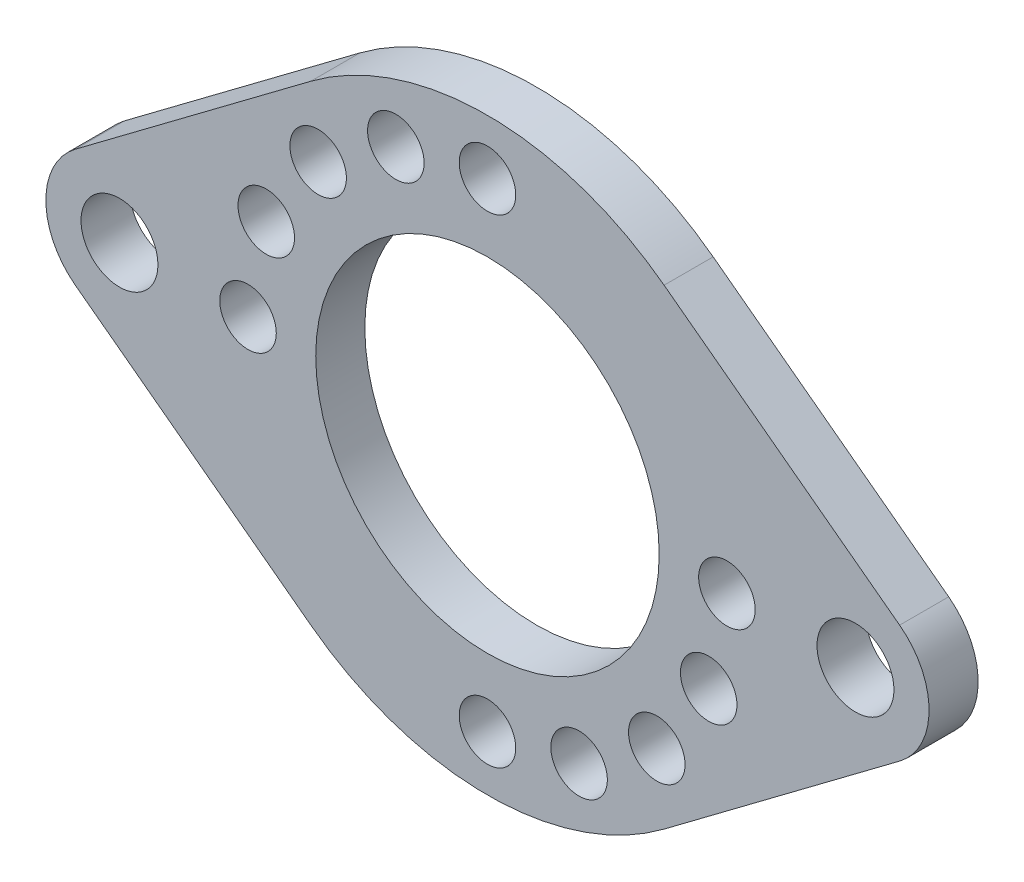
ISO-10303-21;
HEADER;
FILE_DESCRIPTION(('STEP AP214'),'2;1');
FILE_NAME('part.step','',(''),(''),'','','');
FILE_SCHEMA(('AUTOMOTIVE_DESIGN { 1 0 10303 214 1 1 1 1 }'));
ENDSEC;
DATA;
#1=APPLICATION_CONTEXT('core data for automotive mechanical design processes');
#2=APPLICATION_PROTOCOL_DEFINITION('international standard','automotive_design',2000,#1);
#3=PRODUCT_CONTEXT('',#1,'mechanical');
#4=PRODUCT('Part','Part','',(#3));
#5=PRODUCT_RELATED_PRODUCT_CATEGORY('part','',(#4));
#6=PRODUCT_DEFINITION_FORMATION('','',#4);
#7=PRODUCT_DEFINITION_CONTEXT('part definition',#1,'design');
#8=PRODUCT_DEFINITION('design','',#6,#7);
#9=PRODUCT_DEFINITION_SHAPE('','',#8);
#10=(LENGTH_UNIT() NAMED_UNIT(*) SI_UNIT(.MILLI.,.METRE.));
#11=(NAMED_UNIT(*) PLANE_ANGLE_UNIT() SI_UNIT($,.RADIAN.));
#12=(NAMED_UNIT(*) SI_UNIT($,.STERADIAN.) SOLID_ANGLE_UNIT());
#13=UNCERTAINTY_MEASURE_WITH_UNIT(LENGTH_MEASURE(1.E-05),#10,'distance_accuracy_value','');
#14=(GEOMETRIC_REPRESENTATION_CONTEXT(3) GLOBAL_UNCERTAINTY_ASSIGNED_CONTEXT((#13)) GLOBAL_UNIT_ASSIGNED_CONTEXT((#10,
#11,#12)) REPRESENTATION_CONTEXT('',''));
#15=CARTESIAN_POINT('',(0.,0.,0.));
#16=DIRECTION('',(0.,0.,1.));
#17=DIRECTION('',(1.,0.,0.));
#18=AXIS2_PLACEMENT_3D('',#15,#16,#17);
#19=CARTESIAN_POINT('',(0.,0.,-1.5875));
#20=DIRECTION('',(0.,0.,1.));
#21=DIRECTION('',(1.,0.,0.));
#22=AXIS2_PLACEMENT_3D('',#19,#20,#21);
#23=PLANE('',#22);
#24=CARTESIAN_POINT('',(0.,0.,-1.5875));
#25=DIRECTION('',(0.,0.,-1.));
#26=DIRECTION('',(-1.,0.,0.));
#27=AXIS2_PLACEMENT_3D('',#24,#25,#26);
#28=CIRCLE('',#27,11.1125);
#29=CARTESIAN_POINT('',(-11.1125,0.,-1.5875));
#30=VERTEX_POINT('',#29);
#31=EDGE_CURVE('E168',#30,#30,#28,.F.);
#32=ORIENTED_EDGE('',*,*,#31,.T.);
#33=EDGE_LOOP('',(#32));
#34=FACE_BOUND('',#33,.T.);
#35=CARTESIAN_POINT('',(-23.8125,0.,-1.5875));
#36=DIRECTION('',(0.,0.,-1.));
#37=DIRECTION('',(-1.,0.,0.));
#38=AXIS2_PLACEMENT_3D('',#35,#36,#37);
#39=CIRCLE('',#38,4.7625);
#40=CARTESIAN_POINT('',(-26.67,3.81,-1.5875));
#41=VERTEX_POINT('',#40);
#42=CARTESIAN_POINT('',(-26.67,-3.81,-1.5875));
#43=VERTEX_POINT('',#42);
#44=EDGE_CURVE('E172',#41,#43,#39,.F.);
#45=ORIENTED_EDGE('',*,*,#44,.F.);
#46=DIRECTION('',(-0.8,-0.6,0.));
#47=VECTOR('',#46,1.);
#48=CARTESIAN_POINT('',(-11.43,15.24,-1.5875));
#49=LINE('',#48,#47);
#50=CARTESIAN_POINT('',(-11.43,15.24,-1.5875));
#51=VERTEX_POINT('',#50);
#52=EDGE_CURVE('E111',#51,#41,#49,.T.);
#53=ORIENTED_EDGE('',*,*,#52,.F.);
#54=CARTESIAN_POINT('',(0.,0.,-1.5875));
#55=DIRECTION('',(0.,0.,-1.));
#56=DIRECTION('',(-1.,0.,0.));
#57=AXIS2_PLACEMENT_3D('',#54,#55,#56);
#58=CIRCLE('',#57,19.05);
#59=CARTESIAN_POINT('',(11.43,15.24,-1.5875));
#60=VERTEX_POINT('',#59);
#61=EDGE_CURVE('E116',#60,#51,#58,.F.);
#62=ORIENTED_EDGE('',*,*,#61,.F.);
#63=DIRECTION('',(0.8,-0.6,0.));
#64=VECTOR('',#63,1.);
#65=CARTESIAN_POINT('',(11.43,15.24,-1.5875));
#66=LINE('',#65,#64);
#67=CARTESIAN_POINT('',(26.67,3.81,-1.5875));
#68=VERTEX_POINT('',#67);
#69=EDGE_CURVE('E115',#60,#68,#66,.T.);
#70=ORIENTED_EDGE('',*,*,#69,.T.);
#71=CARTESIAN_POINT('',(23.8125,0.,-1.5875));
#72=DIRECTION('',(0.,0.,-1.));
#73=DIRECTION('',(-1.,0.,0.));
#74=AXIS2_PLACEMENT_3D('',#71,#72,#73);
#75=CIRCLE('',#74,4.7625);
#76=CARTESIAN_POINT('',(26.67,-3.81,-1.5875));
#77=VERTEX_POINT('',#76);
#78=EDGE_CURVE('E95',#77,#68,#75,.F.);
#79=ORIENTED_EDGE('',*,*,#78,.F.);
#80=DIRECTION('',(-0.8,-0.6,0.));
#81=VECTOR('',#80,1.);
#82=CARTESIAN_POINT('',(11.43,-15.24,-1.5875));
#83=LINE('',#82,#81);
#84=CARTESIAN_POINT('',(11.43,-15.24,-1.5875));
#85=VERTEX_POINT('',#84);
#86=EDGE_CURVE('E92',#77,#85,#83,.T.);
#87=ORIENTED_EDGE('',*,*,#86,.T.);
#88=CARTESIAN_POINT('',(0.,0.,-1.5875));
#89=DIRECTION('',(0.,0.,-1.));
#90=DIRECTION('',(-1.,0.,0.));
#91=AXIS2_PLACEMENT_3D('',#88,#89,#90);
#92=CIRCLE('',#91,19.05);
#93=CARTESIAN_POINT('',(-11.43,-15.24,-1.5875));
#94=VERTEX_POINT('',#93);
#95=EDGE_CURVE('E79',#94,#85,#92,.F.);
#96=ORIENTED_EDGE('',*,*,#95,.F.);
#97=DIRECTION('',(-0.8,0.6,0.));
#98=VECTOR('',#97,1.);
#99=CARTESIAN_POINT('',(-11.43,-15.24,-1.5875));
#100=LINE('',#99,#98);
#101=EDGE_CURVE('E89',#94,#43,#100,.T.);
#102=ORIENTED_EDGE('',*,*,#101,.T.);
#103=EDGE_LOOP('',(#45,#53,#62,#70,#79,#87,#96,#102));
#104=FACE_BOUND('',#103,.T.);
#105=CARTESIAN_POINT('',(0.,15.494,-1.5875));
#106=DIRECTION('',(0.,0.,1.));
#107=DIRECTION('',(1.,0.,0.));
#108=AXIS2_PLACEMENT_3D('',#105,#106,#107);
#109=CIRCLE('',#108,1.82879999999999);
#110=CARTESIAN_POINT('',(1.82879999999999,15.494,-1.5875));
#111=VERTEX_POINT('',#110);
#112=EDGE_CURVE('E110',#111,#111,#109,.T.);
#113=ORIENTED_EDGE('',*,*,#112,.T.);
#114=EDGE_LOOP('',(#113));
#115=FACE_BOUND('',#114,.T.);
#116=CARTESIAN_POINT('',(-15.494,0.,-1.5875));
#117=DIRECTION('',(0.,0.,1.));
#118=DIRECTION('',(1.,0.,0.));
#119=AXIS2_PLACEMENT_3D('',#116,#117,#118);
#120=CIRCLE('',#119,1.82879999999999);
#121=CARTESIAN_POINT('',(-13.6652,0.,-1.5875));
#122=VERTEX_POINT('',#121);
#123=EDGE_CURVE('E180',#122,#122,#120,.T.);
#124=ORIENTED_EDGE('',*,*,#123,.T.);
#125=EDGE_LOOP('',(#124));
#126=FACE_BOUND('',#125,.T.);
#127=CARTESIAN_POINT('',(-14.3145894767299,5.92929710106476,-1.5875));
#128=DIRECTION('',(0.,0.,1.));
#129=DIRECTION('',(1.,0.,0.));
#130=AXIS2_PLACEMENT_3D('',#127,#128,#129);
#131=CIRCLE('',#130,1.82879999999999);
#132=CARTESIAN_POINT('',(-12.4857894767299,5.92929710106476,-1.5875));
#133=VERTEX_POINT('',#132);
#134=EDGE_CURVE('E183',#133,#133,#131,.T.);
#135=ORIENTED_EDGE('',*,*,#134,.T.);
#136=EDGE_LOOP('',(#135));
#137=FACE_BOUND('',#136,.T.);
#138=CARTESIAN_POINT('',(-5.92929710106471,14.3145894767299,-1.5875));
#139=DIRECTION('',(0.,0.,1.));
#140=DIRECTION('',(1.,0.,0.));
#141=AXIS2_PLACEMENT_3D('',#138,#139,#140);
#142=CIRCLE('',#141,1.82879999999999);
#143=CARTESIAN_POINT('',(-4.10049710106472,14.3145894767299,-1.5875));
#144=VERTEX_POINT('',#143);
#145=EDGE_CURVE('E186',#144,#144,#142,.T.);
#146=ORIENTED_EDGE('',*,*,#145,.T.);
#147=EDGE_LOOP('',(#146));
#148=FACE_BOUND('',#147,.T.);
#149=CARTESIAN_POINT('',(-10.9559124677044,10.9559124677043,-1.5875));
#150=DIRECTION('',(0.,0.,1.));
#151=DIRECTION('',(1.,0.,0.));
#152=AXIS2_PLACEMENT_3D('',#149,#150,#151);
#153=CIRCLE('',#152,1.82879999999999);
#154=CARTESIAN_POINT('',(-9.1271124677044,10.9559124677043,-1.5875));
#155=VERTEX_POINT('',#154);
#156=EDGE_CURVE('E189',#155,#155,#153,.T.);
#157=ORIENTED_EDGE('',*,*,#156,.T.);
#158=EDGE_LOOP('',(#157));
#159=FACE_BOUND('',#158,.T.);
#160=CARTESIAN_POINT('',(0.,-15.494,-1.5875));
#161=DIRECTION('',(0.,0.,1.));
#162=DIRECTION('',(1.,0.,0.));
#163=AXIS2_PLACEMENT_3D('',#160,#161,#162);
#164=CIRCLE('',#163,1.82879999999999);
#165=CARTESIAN_POINT('',(1.82879999999999,-15.494,-1.5875));
#166=VERTEX_POINT('',#165);
#167=EDGE_CURVE('E192',#166,#166,#164,.T.);
#168=ORIENTED_EDGE('',*,*,#167,.T.);
#169=EDGE_LOOP('',(#168));
#170=FACE_BOUND('',#169,.T.);
#171=CARTESIAN_POINT('',(15.494,0.,-1.5875));
#172=DIRECTION('',(0.,0.,1.));
#173=DIRECTION('',(1.,0.,0.));
#174=AXIS2_PLACEMENT_3D('',#171,#172,#173);
#175=CIRCLE('',#174,1.82879999999999);
#176=CARTESIAN_POINT('',(17.3228,0.,-1.5875));
#177=VERTEX_POINT('',#176);
#178=EDGE_CURVE('E195',#177,#177,#175,.T.);
#179=ORIENTED_EDGE('',*,*,#178,.T.);
#180=EDGE_LOOP('',(#179));
#181=FACE_BOUND('',#180,.T.);
#182=CARTESIAN_POINT('',(14.3145894767299,-5.92929710106476,-1.5875));
#183=DIRECTION('',(0.,0.,1.));
#184=DIRECTION('',(1.,0.,0.));
#185=AXIS2_PLACEMENT_3D('',#182,#183,#184);
#186=CIRCLE('',#185,1.82879999999999);
#187=CARTESIAN_POINT('',(16.1433894767298,-5.92929710106476,-1.5875));
#188=VERTEX_POINT('',#187);
#189=EDGE_CURVE('E198',#188,#188,#186,.T.);
#190=ORIENTED_EDGE('',*,*,#189,.T.);
#191=EDGE_LOOP('',(#190));
#192=FACE_BOUND('',#191,.T.);
#193=CARTESIAN_POINT('',(5.92929710106471,-14.3145894767299,-1.5875));
#194=DIRECTION('',(0.,0.,1.));
#195=DIRECTION('',(1.,0.,0.));
#196=AXIS2_PLACEMENT_3D('',#193,#194,#195);
#197=CIRCLE('',#196,1.82879999999999);
#198=CARTESIAN_POINT('',(7.7580971010647,-14.3145894767299,-1.5875));
#199=VERTEX_POINT('',#198);
#200=EDGE_CURVE('E201',#199,#199,#197,.T.);
#201=ORIENTED_EDGE('',*,*,#200,.T.);
#202=EDGE_LOOP('',(#201));
#203=FACE_BOUND('',#202,.T.);
#204=CARTESIAN_POINT('',(10.9559124677044,-10.9559124677043,-1.5875));
#205=DIRECTION('',(0.,0.,1.));
#206=DIRECTION('',(1.,0.,0.));
#207=AXIS2_PLACEMENT_3D('',#204,#205,#206);
#208=CIRCLE('',#207,1.82879999999999);
#209=CARTESIAN_POINT('',(12.7847124677044,-10.9559124677043,-1.5875));
#210=VERTEX_POINT('',#209);
#211=EDGE_CURVE('E204',#210,#210,#208,.T.);
#212=ORIENTED_EDGE('',*,*,#211,.T.);
#213=EDGE_LOOP('',(#212));
#214=FACE_BOUND('',#213,.T.);
#215=CARTESIAN_POINT('',(-23.8125,0.,-1.5875));
#216=DIRECTION('',(0.,0.,1.));
#217=DIRECTION('',(1.,0.,0.));
#218=AXIS2_PLACEMENT_3D('',#215,#216,#217);
#219=CIRCLE('',#218,2.48919999999999);
#220=CARTESIAN_POINT('',(-21.3233,0.,-1.5875));
#221=VERTEX_POINT('',#220);
#222=EDGE_CURVE('E206',#221,#221,#219,.T.);
#223=ORIENTED_EDGE('',*,*,#222,.T.);
#224=EDGE_LOOP('',(#223));
#225=FACE_BOUND('',#224,.T.);
#226=CARTESIAN_POINT('',(23.8125,0.,-1.5875));
#227=DIRECTION('',(0.,0.,1.));
#228=DIRECTION('',(1.,0.,0.));
#229=AXIS2_PLACEMENT_3D('',#226,#227,#228);
#230=CIRCLE('',#229,2.48919999999999);
#231=CARTESIAN_POINT('',(26.3017,0.,-1.5875));
#232=VERTEX_POINT('',#231);
#233=EDGE_CURVE('E20',#232,#232,#230,.T.);
#234=ORIENTED_EDGE('',*,*,#233,.T.);
#235=EDGE_LOOP('',(#234));
#236=FACE_BOUND('',#235,.T.);
#237=ADVANCED_FACE('F17',(#34,#104,#115,#126,#137,#148,#159,#170,#181,#192,#203,#214,#225,#236),
#23,.F.);
#238=CARTESIAN_POINT('',(23.8125,0.,1.5875));
#239=DIRECTION('',(0.,0.,1.));
#240=DIRECTION('',(1.,0.,0.));
#241=AXIS2_PLACEMENT_3D('',#238,#239,#240);
#242=CYLINDRICAL_SURFACE('',#241,2.48919999999999);
#243=CARTESIAN_POINT('',(23.8125,0.,1.5875));
#244=DIRECTION('',(0.,0.,1.));
#245=DIRECTION('',(1.,0.,0.));
#246=AXIS2_PLACEMENT_3D('',#243,#244,#245);
#247=CIRCLE('',#246,2.48919999999999);
#248=CARTESIAN_POINT('',(26.3017,0.,1.5875));
#249=VERTEX_POINT('',#248);
#250=EDGE_CURVE('E165',#249,#249,#247,.F.);
#251=ORIENTED_EDGE('',*,*,#250,.F.);
#252=EDGE_LOOP('',(#251));
#253=FACE_BOUND('',#252,.T.);
#254=ORIENTED_EDGE('',*,*,#233,.F.);
#255=EDGE_LOOP('',(#254));
#256=FACE_BOUND('',#255,.T.);
#257=ADVANCED_FACE('F214',(#253,#256),#242,.F.);
#258=CARTESIAN_POINT('',(-23.8125,0.,1.5875));
#259=DIRECTION('',(0.,0.,1.));
#260=DIRECTION('',(1.,0.,0.));
#261=AXIS2_PLACEMENT_3D('',#258,#259,#260);
#262=CYLINDRICAL_SURFACE('',#261,2.48919999999999);
#263=CARTESIAN_POINT('',(-23.8125,0.,1.5875));
#264=DIRECTION('',(0.,0.,1.));
#265=DIRECTION('',(1.,0.,0.));
#266=AXIS2_PLACEMENT_3D('',#263,#264,#265);
#267=CIRCLE('',#266,2.48919999999999);
#268=CARTESIAN_POINT('',(-21.3233,0.,1.5875));
#269=VERTEX_POINT('',#268);
#270=EDGE_CURVE('E162',#269,#269,#267,.F.);
#271=ORIENTED_EDGE('',*,*,#270,.F.);
#272=EDGE_LOOP('',(#271));
#273=FACE_BOUND('',#272,.T.);
#274=ORIENTED_EDGE('',*,*,#222,.F.);
#275=EDGE_LOOP('',(#274));
#276=FACE_BOUND('',#275,.T.);
#277=ADVANCED_FACE('F216',(#273,#276),#262,.F.);
#278=CARTESIAN_POINT('',(10.9559124677044,-10.9559124677043,1.5875));
#279=DIRECTION('',(0.,0.,1.));
#280=DIRECTION('',(1.,0.,0.));
#281=AXIS2_PLACEMENT_3D('',#278,#279,#280);
#282=CYLINDRICAL_SURFACE('',#281,1.82879999999999);
#283=CARTESIAN_POINT('',(10.9559124677044,-10.9559124677043,1.5875));
#284=DIRECTION('',(0.,0.,1.));
#285=DIRECTION('',(1.,0.,0.));
#286=AXIS2_PLACEMENT_3D('',#283,#284,#285);
#287=CIRCLE('',#286,1.82879999999999);
#288=CARTESIAN_POINT('',(12.7847124677044,-10.9559124677043,1.5875));
#289=VERTEX_POINT('',#288);
#290=EDGE_CURVE('E159',#289,#289,#287,.F.);
#291=ORIENTED_EDGE('',*,*,#290,.F.);
#292=EDGE_LOOP('',(#291));
#293=FACE_BOUND('',#292,.T.);
#294=ORIENTED_EDGE('',*,*,#211,.F.);
#295=EDGE_LOOP('',(#294));
#296=FACE_BOUND('',#295,.T.);
#297=ADVANCED_FACE('F223',(#293,#296),#282,.F.);
#298=CARTESIAN_POINT('',(5.92929710106471,-14.3145894767299,1.5875));
#299=DIRECTION('',(0.,0.,1.));
#300=DIRECTION('',(1.,0.,0.));
#301=AXIS2_PLACEMENT_3D('',#298,#299,#300);
#302=CYLINDRICAL_SURFACE('',#301,1.82879999999999);
#303=CARTESIAN_POINT('',(5.92929710106471,-14.3145894767299,1.5875));
#304=DIRECTION('',(0.,0.,1.));
#305=DIRECTION('',(1.,0.,0.));
#306=AXIS2_PLACEMENT_3D('',#303,#304,#305);
#307=CIRCLE('',#306,1.82879999999999);
#308=CARTESIAN_POINT('',(7.7580971010647,-14.3145894767299,1.5875));
#309=VERTEX_POINT('',#308);
#310=EDGE_CURVE('E156',#309,#309,#307,.F.);
#311=ORIENTED_EDGE('',*,*,#310,.F.);
#312=EDGE_LOOP('',(#311));
#313=FACE_BOUND('',#312,.T.);
#314=ORIENTED_EDGE('',*,*,#200,.F.);
#315=EDGE_LOOP('',(#314));
#316=FACE_BOUND('',#315,.T.);
#317=ADVANCED_FACE('F299',(#313,#316),#302,.F.);
#318=CARTESIAN_POINT('',(14.3145894767299,-5.92929710106476,1.5875));
#319=DIRECTION('',(0.,0.,1.));
#320=DIRECTION('',(1.,0.,0.));
#321=AXIS2_PLACEMENT_3D('',#318,#319,#320);
#322=CYLINDRICAL_SURFACE('',#321,1.82879999999999);
#323=CARTESIAN_POINT('',(14.3145894767299,-5.92929710106476,1.5875));
#324=DIRECTION('',(0.,0.,1.));
#325=DIRECTION('',(1.,0.,0.));
#326=AXIS2_PLACEMENT_3D('',#323,#324,#325);
#327=CIRCLE('',#326,1.82879999999999);
#328=CARTESIAN_POINT('',(16.1433894767298,-5.92929710106476,1.5875));
#329=VERTEX_POINT('',#328);
#330=EDGE_CURVE('E153',#329,#329,#327,.F.);
#331=ORIENTED_EDGE('',*,*,#330,.F.);
#332=EDGE_LOOP('',(#331));
#333=FACE_BOUND('',#332,.T.);
#334=ORIENTED_EDGE('',*,*,#189,.F.);
#335=EDGE_LOOP('',(#334));
#336=FACE_BOUND('',#335,.T.);
#337=ADVANCED_FACE('F295',(#333,#336),#322,.F.);
#338=CARTESIAN_POINT('',(15.494,0.,1.5875));
#339=DIRECTION('',(0.,0.,1.));
#340=DIRECTION('',(1.,0.,0.));
#341=AXIS2_PLACEMENT_3D('',#338,#339,#340);
#342=CYLINDRICAL_SURFACE('',#341,1.82879999999999);
#343=CARTESIAN_POINT('',(15.494,0.,1.5875));
#344=DIRECTION('',(0.,0.,1.));
#345=DIRECTION('',(1.,0.,0.));
#346=AXIS2_PLACEMENT_3D('',#343,#344,#345);
#347=CIRCLE('',#346,1.82879999999999);
#348=CARTESIAN_POINT('',(17.3228,0.,1.5875));
#349=VERTEX_POINT('',#348);
#350=EDGE_CURVE('E150',#349,#349,#347,.F.);
#351=ORIENTED_EDGE('',*,*,#350,.F.);
#352=EDGE_LOOP('',(#351));
#353=FACE_BOUND('',#352,.T.);
#354=ORIENTED_EDGE('',*,*,#178,.F.);
#355=EDGE_LOOP('',(#354));
#356=FACE_BOUND('',#355,.T.);
#357=ADVANCED_FACE('F291',(#353,#356),#342,.F.);
#358=CARTESIAN_POINT('',(0.,-15.494,1.5875));
#359=DIRECTION('',(0.,0.,1.));
#360=DIRECTION('',(1.,0.,0.));
#361=AXIS2_PLACEMENT_3D('',#358,#359,#360);
#362=CYLINDRICAL_SURFACE('',#361,1.82879999999999);
#363=CARTESIAN_POINT('',(0.,-15.494,1.5875));
#364=DIRECTION('',(0.,0.,1.));
#365=DIRECTION('',(1.,0.,0.));
#366=AXIS2_PLACEMENT_3D('',#363,#364,#365);
#367=CIRCLE('',#366,1.82879999999999);
#368=CARTESIAN_POINT('',(1.82879999999999,-15.494,1.5875));
#369=VERTEX_POINT('',#368);
#370=EDGE_CURVE('E147',#369,#369,#367,.F.);
#371=ORIENTED_EDGE('',*,*,#370,.F.);
#372=EDGE_LOOP('',(#371));
#373=FACE_BOUND('',#372,.T.);
#374=ORIENTED_EDGE('',*,*,#167,.F.);
#375=EDGE_LOOP('',(#374));
#376=FACE_BOUND('',#375,.T.);
#377=ADVANCED_FACE('F287',(#373,#376),#362,.F.);
#378=CARTESIAN_POINT('',(-10.9559124677044,10.9559124677043,1.5875));
#379=DIRECTION('',(0.,0.,1.));
#380=DIRECTION('',(1.,0.,0.));
#381=AXIS2_PLACEMENT_3D('',#378,#379,#380);
#382=CYLINDRICAL_SURFACE('',#381,1.82879999999999);
#383=CARTESIAN_POINT('',(-10.9559124677044,10.9559124677043,1.5875));
#384=DIRECTION('',(0.,0.,1.));
#385=DIRECTION('',(1.,0.,0.));
#386=AXIS2_PLACEMENT_3D('',#383,#384,#385);
#387=CIRCLE('',#386,1.82879999999999);
#388=CARTESIAN_POINT('',(-9.1271124677044,10.9559124677043,1.5875));
#389=VERTEX_POINT('',#388);
#390=EDGE_CURVE('E144',#389,#389,#387,.F.);
#391=ORIENTED_EDGE('',*,*,#390,.F.);
#392=EDGE_LOOP('',(#391));
#393=FACE_BOUND('',#392,.T.);
#394=ORIENTED_EDGE('',*,*,#156,.F.);
#395=EDGE_LOOP('',(#394));
#396=FACE_BOUND('',#395,.T.);
#397=ADVANCED_FACE('F283',(#393,#396),#382,.F.);
#398=CARTESIAN_POINT('',(-5.92929710106471,14.3145894767299,1.5875));
#399=DIRECTION('',(0.,0.,1.));
#400=DIRECTION('',(1.,0.,0.));
#401=AXIS2_PLACEMENT_3D('',#398,#399,#400);
#402=CYLINDRICAL_SURFACE('',#401,1.82879999999999);
#403=CARTESIAN_POINT('',(-5.92929710106471,14.3145894767299,1.5875));
#404=DIRECTION('',(0.,0.,1.));
#405=DIRECTION('',(1.,0.,0.));
#406=AXIS2_PLACEMENT_3D('',#403,#404,#405);
#407=CIRCLE('',#406,1.82879999999999);
#408=CARTESIAN_POINT('',(-4.10049710106472,14.3145894767299,1.5875));
#409=VERTEX_POINT('',#408);
#410=EDGE_CURVE('E141',#409,#409,#407,.F.);
#411=ORIENTED_EDGE('',*,*,#410,.F.);
#412=EDGE_LOOP('',(#411));
#413=FACE_BOUND('',#412,.T.);
#414=ORIENTED_EDGE('',*,*,#145,.F.);
#415=EDGE_LOOP('',(#414));
#416=FACE_BOUND('',#415,.T.);
#417=ADVANCED_FACE('F279',(#413,#416),#402,.F.);
#418=CARTESIAN_POINT('',(-14.3145894767299,5.92929710106476,1.5875));
#419=DIRECTION('',(0.,0.,1.));
#420=DIRECTION('',(1.,0.,0.));
#421=AXIS2_PLACEMENT_3D('',#418,#419,#420);
#422=CYLINDRICAL_SURFACE('',#421,1.82879999999999);
#423=CARTESIAN_POINT('',(-14.3145894767299,5.92929710106476,1.5875));
#424=DIRECTION('',(0.,0.,1.));
#425=DIRECTION('',(1.,0.,0.));
#426=AXIS2_PLACEMENT_3D('',#423,#424,#425);
#427=CIRCLE('',#426,1.82879999999999);
#428=CARTESIAN_POINT('',(-12.4857894767299,5.92929710106476,1.5875));
#429=VERTEX_POINT('',#428);
#430=EDGE_CURVE('E138',#429,#429,#427,.F.);
#431=ORIENTED_EDGE('',*,*,#430,.F.);
#432=EDGE_LOOP('',(#431));
#433=FACE_BOUND('',#432,.T.);
#434=ORIENTED_EDGE('',*,*,#134,.F.);
#435=EDGE_LOOP('',(#434));
#436=FACE_BOUND('',#435,.T.);
#437=ADVANCED_FACE('F275',(#433,#436),#422,.F.);
#438=CARTESIAN_POINT('',(-15.494,0.,1.5875));
#439=DIRECTION('',(0.,0.,1.));
#440=DIRECTION('',(1.,0.,0.));
#441=AXIS2_PLACEMENT_3D('',#438,#439,#440);
#442=CYLINDRICAL_SURFACE('',#441,1.82879999999999);
#443=CARTESIAN_POINT('',(-15.494,0.,1.5875));
#444=DIRECTION('',(0.,0.,1.));
#445=DIRECTION('',(1.,0.,0.));
#446=AXIS2_PLACEMENT_3D('',#443,#444,#445);
#447=CIRCLE('',#446,1.82879999999999);
#448=CARTESIAN_POINT('',(-13.6652,0.,1.5875));
#449=VERTEX_POINT('',#448);
#450=EDGE_CURVE('E135',#449,#449,#447,.F.);
#451=ORIENTED_EDGE('',*,*,#450,.F.);
#452=EDGE_LOOP('',(#451));
#453=FACE_BOUND('',#452,.T.);
#454=ORIENTED_EDGE('',*,*,#123,.F.);
#455=EDGE_LOOP('',(#454));
#456=FACE_BOUND('',#455,.T.);
#457=ADVANCED_FACE('F271',(#453,#456),#442,.F.);
#458=CARTESIAN_POINT('',(0.,15.494,1.5875));
#459=DIRECTION('',(0.,0.,1.));
#460=DIRECTION('',(1.,0.,0.));
#461=AXIS2_PLACEMENT_3D('',#458,#459,#460);
#462=CYLINDRICAL_SURFACE('',#461,1.82879999999999);
#463=CARTESIAN_POINT('',(0.,15.494,1.5875));
#464=DIRECTION('',(0.,0.,1.));
#465=DIRECTION('',(1.,0.,0.));
#466=AXIS2_PLACEMENT_3D('',#463,#464,#465);
#467=CIRCLE('',#466,1.82879999999999);
#468=CARTESIAN_POINT('',(1.82879999999999,15.494,1.5875));
#469=VERTEX_POINT('',#468);
#470=EDGE_CURVE('E132',#469,#469,#467,.F.);
#471=ORIENTED_EDGE('',*,*,#470,.F.);
#472=EDGE_LOOP('',(#471));
#473=FACE_BOUND('',#472,.T.);
#474=ORIENTED_EDGE('',*,*,#112,.F.);
#475=EDGE_LOOP('',(#474));
#476=FACE_BOUND('',#475,.T.);
#477=ADVANCED_FACE('F267',(#473,#476),#462,.F.);
#478=CARTESIAN_POINT('',(-11.43,-15.24,1.5875));
#479=DIRECTION('',(0.6,0.8,0.));
#480=DIRECTION('',(-0.8,0.6,0.));
#481=AXIS2_PLACEMENT_3D('',#478,#479,#480);
#482=PLANE('',#481);
#483=DIRECTION('',(0.,0.,-1.));
#484=VECTOR('',#483,1.);
#485=CARTESIAN_POINT('',(-11.43,-15.24,1.5875));
#486=LINE('',#485,#484);
#487=CARTESIAN_POINT('',(-11.43,-15.24,1.5875));
#488=VERTEX_POINT('',#487);
#489=EDGE_CURVE('E88',#488,#94,#486,.T.);
#490=ORIENTED_EDGE('',*,*,#489,.F.);
#491=DIRECTION('',(0.8,-0.6,0.));
#492=VECTOR('',#491,1.);
#493=CARTESIAN_POINT('',(-26.67,-3.81,1.5875));
#494=LINE('',#493,#492);
#495=CARTESIAN_POINT('',(-26.67,-3.81,1.5875));
#496=VERTEX_POINT('',#495);
#497=EDGE_CURVE('E131',#496,#488,#494,.T.);
#498=ORIENTED_EDGE('',*,*,#497,.F.);
#499=DIRECTION('',(0.,0.,-1.));
#500=VECTOR('',#499,1.);
#501=CARTESIAN_POINT('',(-26.67,-3.81,1.5875));
#502=LINE('',#501,#500);
#503=EDGE_CURVE('E171',#43,#496,#502,.F.);
#504=ORIENTED_EDGE('',*,*,#503,.F.);
#505=ORIENTED_EDGE('',*,*,#101,.F.);
#506=EDGE_LOOP('',(#490,#498,#504,#505));
#507=FACE_BOUND('',#506,.T.);
#508=ADVANCED_FACE('F264',(#507),#482,.F.);
#509=CARTESIAN_POINT('',(0.,0.,1.5875));
#510=DIRECTION('',(0.,0.,-1.));
#511=DIRECTION('',(-1.,0.,0.));
#512=AXIS2_PLACEMENT_3D('',#509,#510,#511);
#513=CYLINDRICAL_SURFACE('',#512,19.05);
#514=CARTESIAN_POINT('',(0.,0.,1.5875));
#515=DIRECTION('',(0.,0.,-1.));
#516=DIRECTION('',(-1.,0.,0.));
#517=AXIS2_PLACEMENT_3D('',#514,#515,#516);
#518=CIRCLE('',#517,19.05);
#519=CARTESIAN_POINT('',(11.43,-15.24,1.5875));
#520=VERTEX_POINT('',#519);
#521=EDGE_CURVE('E129',#488,#520,#518,.F.);
#522=ORIENTED_EDGE('',*,*,#521,.F.);
#523=ORIENTED_EDGE('',*,*,#489,.T.);
#524=ORIENTED_EDGE('',*,*,#95,.T.);
#525=DIRECTION('',(0.,0.,1.));
#526=VECTOR('',#525,1.);
#527=CARTESIAN_POINT('',(11.43,-15.24,1.5875));
#528=LINE('',#527,#526);
#529=EDGE_CURVE('E86',#85,#520,#528,.T.);
#530=ORIENTED_EDGE('',*,*,#529,.T.);
#531=EDGE_LOOP('',(#522,#523,#524,#530));
#532=FACE_BOUND('',#531,.T.);
#533=ADVANCED_FACE('F84',(#532),#513,.T.);
#534=CARTESIAN_POINT('',(11.43,-15.24,1.5875));
#535=DIRECTION('',(-0.6,0.8,0.));
#536=DIRECTION('',(-0.8,-0.6,0.));
#537=AXIS2_PLACEMENT_3D('',#534,#535,#536);
#538=PLANE('',#537);
#539=DIRECTION('',(0.,0.,-1.));
#540=VECTOR('',#539,1.);
#541=CARTESIAN_POINT('',(26.67,-3.81,1.5875));
#542=LINE('',#541,#540);
#543=CARTESIAN_POINT('',(26.67,-3.81,1.5875));
#544=VERTEX_POINT('',#543);
#545=EDGE_CURVE('E106',#544,#77,#542,.T.);
#546=ORIENTED_EDGE('',*,*,#545,.F.);
#547=DIRECTION('',(0.8,0.6,0.));
#548=VECTOR('',#547,1.);
#549=CARTESIAN_POINT('',(11.43,-15.24,1.5875));
#550=LINE('',#549,#548);
#551=EDGE_CURVE('E101',#520,#544,#550,.T.);
#552=ORIENTED_EDGE('',*,*,#551,.F.);
#553=ORIENTED_EDGE('',*,*,#529,.F.);
#554=ORIENTED_EDGE('',*,*,#86,.F.);
#555=EDGE_LOOP('',(#546,#552,#553,#554));
#556=FACE_BOUND('',#555,.T.);
#557=ADVANCED_FACE('F99',(#556),#538,.F.);
#558=CARTESIAN_POINT('',(23.8125,0.,1.5875));
#559=DIRECTION('',(0.,0.,-1.));
#560=DIRECTION('',(-1.,0.,0.));
#561=AXIS2_PLACEMENT_3D('',#558,#559,#560);
#562=CYLINDRICAL_SURFACE('',#561,4.7625);
#563=CARTESIAN_POINT('',(23.8125,0.,1.5875));
#564=DIRECTION('',(0.,0.,-1.));
#565=DIRECTION('',(-1.,0.,0.));
#566=AXIS2_PLACEMENT_3D('',#563,#564,#565);
#567=CIRCLE('',#566,4.7625);
#568=CARTESIAN_POINT('',(26.67,3.81,1.5875));
#569=VERTEX_POINT('',#568);
#570=EDGE_CURVE('E126',#544,#569,#567,.F.);
#571=ORIENTED_EDGE('',*,*,#570,.F.);
#572=ORIENTED_EDGE('',*,*,#545,.T.);
#573=ORIENTED_EDGE('',*,*,#78,.T.);
#574=DIRECTION('',(0.,0.,1.));
#575=VECTOR('',#574,1.);
#576=CARTESIAN_POINT('',(26.67,3.81,1.5875));
#577=LINE('',#576,#575);
#578=EDGE_CURVE('E117',#68,#569,#577,.T.);
#579=ORIENTED_EDGE('',*,*,#578,.T.);
#580=EDGE_LOOP('',(#571,#572,#573,#579));
#581=FACE_BOUND('',#580,.T.);
#582=ADVANCED_FACE('F255',(#581),#562,.T.);
#583=CARTESIAN_POINT('',(11.43,15.24,1.5875));
#584=DIRECTION('',(-0.6,-0.8,0.));
#585=DIRECTION('',(0.8,-0.6,0.));
#586=AXIS2_PLACEMENT_3D('',#583,#584,#585);
#587=PLANE('',#586);
#588=DIRECTION('',(0.,0.,-1.));
#589=VECTOR('',#588,1.);
#590=CARTESIAN_POINT('',(11.43,15.24,1.5875));
#591=LINE('',#590,#589);
#592=CARTESIAN_POINT('',(11.43,15.24,1.5875));
#593=VERTEX_POINT('',#592);
#594=EDGE_CURVE('E114',#593,#60,#591,.T.);
#595=ORIENTED_EDGE('',*,*,#594,.F.);
#596=DIRECTION('',(-0.8,0.6,0.));
#597=VECTOR('',#596,1.);
#598=CARTESIAN_POINT('',(26.67,3.81,1.5875));
#599=LINE('',#598,#597);
#600=EDGE_CURVE('E125',#569,#593,#599,.T.);
#601=ORIENTED_EDGE('',*,*,#600,.F.);
#602=ORIENTED_EDGE('',*,*,#578,.F.);
#603=ORIENTED_EDGE('',*,*,#69,.F.);
#604=EDGE_LOOP('',(#595,#601,#602,#603));
#605=FACE_BOUND('',#604,.T.);
#606=ADVANCED_FACE('F251',(#605),#587,.F.);
#607=CARTESIAN_POINT('',(0.,0.,1.5875));
#608=DIRECTION('',(0.,0.,-1.));
#609=DIRECTION('',(-1.,0.,0.));
#610=AXIS2_PLACEMENT_3D('',#607,#608,#609);
#611=CYLINDRICAL_SURFACE('',#610,19.05);
#612=CARTESIAN_POINT('',(0.,0.,1.5875));
#613=DIRECTION('',(0.,0.,-1.));
#614=DIRECTION('',(-1.,0.,0.));
#615=AXIS2_PLACEMENT_3D('',#612,#613,#614);
#616=CIRCLE('',#615,19.05);
#617=CARTESIAN_POINT('',(-11.43,15.24,1.5875));
#618=VERTEX_POINT('',#617);
#619=EDGE_CURVE('E122',#593,#618,#616,.F.);
#620=ORIENTED_EDGE('',*,*,#619,.F.);
#621=ORIENTED_EDGE('',*,*,#594,.T.);
#622=ORIENTED_EDGE('',*,*,#61,.T.);
#623=DIRECTION('',(0.,0.,1.));
#624=VECTOR('',#623,1.);
#625=CARTESIAN_POINT('',(-11.43,15.24,1.5875));
#626=LINE('',#625,#624);
#627=EDGE_CURVE('E113',#618,#51,#626,.F.);
#628=ORIENTED_EDGE('',*,*,#627,.F.);
#629=EDGE_LOOP('',(#620,#621,#622,#628));
#630=FACE_BOUND('',#629,.T.);
#631=ADVANCED_FACE('F248',(#630),#611,.T.);
#632=CARTESIAN_POINT('',(-11.43,15.24,1.5875));
#633=DIRECTION('',(-0.6,0.8,0.));
#634=DIRECTION('',(-0.8,-0.6,0.));
#635=AXIS2_PLACEMENT_3D('',#632,#633,#634);
#636=PLANE('',#635);
#637=DIRECTION('',(-0.8,-0.6,0.));
#638=VECTOR('',#637,1.);
#639=CARTESIAN_POINT('',(-11.43,15.24,1.5875));
#640=LINE('',#639,#638);
#641=CARTESIAN_POINT('',(-26.67,3.81,1.5875));
#642=VERTEX_POINT('',#641);
#643=EDGE_CURVE('E121',#618,#642,#640,.T.);
#644=ORIENTED_EDGE('',*,*,#643,.F.);
#645=ORIENTED_EDGE('',*,*,#627,.T.);
#646=ORIENTED_EDGE('',*,*,#52,.T.);
#647=DIRECTION('',(0.,0.,-1.));
#648=VECTOR('',#647,1.);
#649=CARTESIAN_POINT('',(-26.67,3.81,1.5875));
#650=LINE('',#649,#648);
#651=EDGE_CURVE('E35',#642,#41,#650,.T.);
#652=ORIENTED_EDGE('',*,*,#651,.F.);
#653=EDGE_LOOP('',(#644,#645,#646,#652));
#654=FACE_BOUND('',#653,.T.);
#655=ADVANCED_FACE('F244',(#654),#636,.T.);
#656=CARTESIAN_POINT('',(-23.8125,0.,1.5875));
#657=DIRECTION('',(0.,0.,-1.));
#658=DIRECTION('',(-1.,0.,0.));
#659=AXIS2_PLACEMENT_3D('',#656,#657,#658);
#660=CYLINDRICAL_SURFACE('',#659,4.7625);
#661=ORIENTED_EDGE('',*,*,#44,.T.);
#662=ORIENTED_EDGE('',*,*,#503,.T.);
#663=CARTESIAN_POINT('',(-23.8125,0.,1.5875));
#664=DIRECTION('',(0.,0.,-1.));
#665=DIRECTION('',(-1.,0.,0.));
#666=AXIS2_PLACEMENT_3D('',#663,#664,#665);
#667=CIRCLE('',#666,4.7625);
#668=EDGE_CURVE('E26',#642,#496,#667,.F.);
#669=ORIENTED_EDGE('',*,*,#668,.F.);
#670=ORIENTED_EDGE('',*,*,#651,.T.);
#671=EDGE_LOOP('',(#661,#662,#669,#670));
#672=FACE_BOUND('',#671,.T.);
#673=ADVANCED_FACE('F237',(#672),#660,.T.);
#674=CARTESIAN_POINT('',(0.,0.,1.5875));
#675=DIRECTION('',(0.,0.,-1.));
#676=DIRECTION('',(-1.,0.,0.));
#677=AXIS2_PLACEMENT_3D('',#674,#675,#676);
#678=CYLINDRICAL_SURFACE('',#677,11.1125);
#679=CARTESIAN_POINT('',(0.,0.,1.5875));
#680=DIRECTION('',(0.,0.,-1.));
#681=DIRECTION('',(-1.,0.,0.));
#682=AXIS2_PLACEMENT_3D('',#679,#680,#681);
#683=CIRCLE('',#682,11.1125);
#684=CARTESIAN_POINT('',(-11.1125,0.,1.5875));
#685=VERTEX_POINT('',#684);
#686=EDGE_CURVE('E11',#685,#685,#683,.T.);
#687=ORIENTED_EDGE('',*,*,#686,.F.);
#688=EDGE_LOOP('',(#687));
#689=FACE_BOUND('',#688,.T.);
#690=ORIENTED_EDGE('',*,*,#31,.F.);
#691=EDGE_LOOP('',(#690));
#692=FACE_BOUND('',#691,.T.);
#693=ADVANCED_FACE('F231',(#689,#692),#678,.F.);
#694=CARTESIAN_POINT('',(0.,0.,1.5875));
#695=DIRECTION('',(0.,0.,1.));
#696=DIRECTION('',(1.,0.,0.));
#697=AXIS2_PLACEMENT_3D('',#694,#695,#696);
#698=PLANE('',#697);
#699=ORIENTED_EDGE('',*,*,#686,.T.);
#700=EDGE_LOOP('',(#699));
#701=FACE_BOUND('',#700,.T.);
#702=ORIENTED_EDGE('',*,*,#668,.T.);
#703=ORIENTED_EDGE('',*,*,#497,.T.);
#704=ORIENTED_EDGE('',*,*,#521,.T.);
#705=ORIENTED_EDGE('',*,*,#551,.T.);
#706=ORIENTED_EDGE('',*,*,#570,.T.);
#707=ORIENTED_EDGE('',*,*,#600,.T.);
#708=ORIENTED_EDGE('',*,*,#619,.T.);
#709=ORIENTED_EDGE('',*,*,#643,.T.);
#710=EDGE_LOOP('',(#702,#703,#704,#705,#706,#707,#708,#709));
#711=FACE_BOUND('',#710,.T.);
#712=ORIENTED_EDGE('',*,*,#470,.T.);
#713=EDGE_LOOP('',(#712));
#714=FACE_BOUND('',#713,.T.);
#715=ORIENTED_EDGE('',*,*,#450,.T.);
#716=EDGE_LOOP('',(#715));
#717=FACE_BOUND('',#716,.T.);
#718=ORIENTED_EDGE('',*,*,#430,.T.);
#719=EDGE_LOOP('',(#718));
#720=FACE_BOUND('',#719,.T.);
#721=ORIENTED_EDGE('',*,*,#410,.T.);
#722=EDGE_LOOP('',(#721));
#723=FACE_BOUND('',#722,.T.);
#724=ORIENTED_EDGE('',*,*,#390,.T.);
#725=EDGE_LOOP('',(#724));
#726=FACE_BOUND('',#725,.T.);
#727=ORIENTED_EDGE('',*,*,#370,.T.);
#728=EDGE_LOOP('',(#727));
#729=FACE_BOUND('',#728,.T.);
#730=ORIENTED_EDGE('',*,*,#350,.T.);
#731=EDGE_LOOP('',(#730));
#732=FACE_BOUND('',#731,.T.);
#733=ORIENTED_EDGE('',*,*,#330,.T.);
#734=EDGE_LOOP('',(#733));
#735=FACE_BOUND('',#734,.T.);
#736=ORIENTED_EDGE('',*,*,#310,.T.);
#737=EDGE_LOOP('',(#736));
#738=FACE_BOUND('',#737,.T.);
#739=ORIENTED_EDGE('',*,*,#290,.T.);
#740=EDGE_LOOP('',(#739));
#741=FACE_BOUND('',#740,.T.);
#742=ORIENTED_EDGE('',*,*,#270,.T.);
#743=EDGE_LOOP('',(#742));
#744=FACE_BOUND('',#743,.T.);
#745=ORIENTED_EDGE('',*,*,#250,.T.);
#746=EDGE_LOOP('',(#745));
#747=FACE_BOUND('',#746,.T.);
#748=ADVANCED_FACE('F229',(#701,#711,#714,#717,#720,#723,#726,#729,#732,#735,#738,#741,#744,
#747),#698,.T.);
#749=CLOSED_SHELL('',(#237,#257,#277,#297,#317,#337,#357,#377,#397,#417,#437,#457,#477,#508,
#533,#557,#582,#606,#631,#655,#673,#693,#748));
#750=MANIFOLD_SOLID_BREP('B1',#749);
#751=ADVANCED_BREP_SHAPE_REPRESENTATION('',(#18,#750),#14);
#752=SHAPE_DEFINITION_REPRESENTATION(#9,#751);
ENDSEC;
END-ISO-10303-21;
